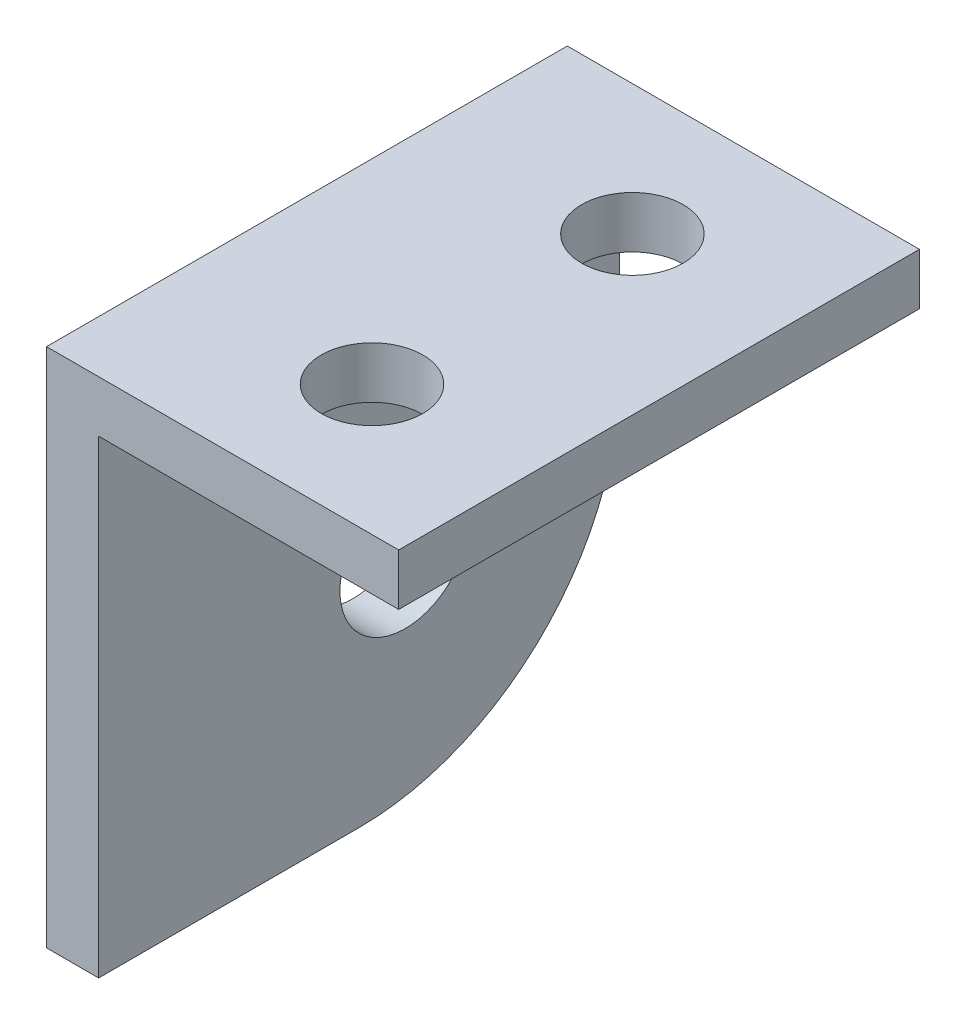
ISO-10303-21;
HEADER;
FILE_DESCRIPTION(('STEP AP214'),'2;1');
FILE_NAME('part.step','',(''),(''),'','','');
FILE_SCHEMA(('AUTOMOTIVE_DESIGN { 1 0 10303 214 1 1 1 1 }'));
ENDSEC;
DATA;
#1=APPLICATION_CONTEXT('core data for automotive mechanical design processes');
#2=APPLICATION_PROTOCOL_DEFINITION('international standard','automotive_design',2000,#1);
#3=PRODUCT_CONTEXT('',#1,'mechanical');
#4=PRODUCT('Part','Part','',(#3));
#5=PRODUCT_RELATED_PRODUCT_CATEGORY('part','',(#4));
#6=PRODUCT_DEFINITION_FORMATION('','',#4);
#7=PRODUCT_DEFINITION_CONTEXT('part definition',#1,'design');
#8=PRODUCT_DEFINITION('design','',#6,#7);
#9=PRODUCT_DEFINITION_SHAPE('','',#8);
#10=(LENGTH_UNIT() NAMED_UNIT(*) SI_UNIT(.MILLI.,.METRE.));
#11=(NAMED_UNIT(*) PLANE_ANGLE_UNIT() SI_UNIT($,.RADIAN.));
#12=(NAMED_UNIT(*) SI_UNIT($,.STERADIAN.) SOLID_ANGLE_UNIT());
#13=UNCERTAINTY_MEASURE_WITH_UNIT(LENGTH_MEASURE(1.E-05),#10,'distance_accuracy_value','');
#14=(GEOMETRIC_REPRESENTATION_CONTEXT(3) GLOBAL_UNCERTAINTY_ASSIGNED_CONTEXT((#13)) GLOBAL_UNIT_ASSIGNED_CONTEXT((#10,
#11,#12)) REPRESENTATION_CONTEXT('',''));
#15=CARTESIAN_POINT('',(0.,0.,0.));
#16=DIRECTION('',(0.,0.,1.));
#17=DIRECTION('',(1.,0.,0.));
#18=AXIS2_PLACEMENT_3D('',#15,#16,#17);
#19=CARTESIAN_POINT('',(4.47675,12.7,25.4));
#20=DIRECTION('',(0.,-1.,0.));
#21=DIRECTION('',(0.,0.,-1.));
#22=AXIS2_PLACEMENT_3D('',#19,#20,#21);
#23=PLANE('',#22);
#24=CARTESIAN_POINT('',(-3.175,12.7,19.05));
#25=DIRECTION('',(0.,-1.,0.));
#26=DIRECTION('',(1.,0.,0.));
#27=AXIS2_PLACEMENT_3D('',#24,#25,#26);
#28=CIRCLE('',#27,2.4765);
#29=CARTESIAN_POINT('',(-0.698500000000002,12.7,19.05));
#30=VERTEX_POINT('',#29);
#31=EDGE_CURVE('E149',#30,#30,#28,.T.);
#32=ORIENTED_EDGE('',*,*,#31,.T.);
#33=EDGE_LOOP('',(#32));
#34=FACE_BOUND('',#33,.T.);
#35=CARTESIAN_POINT('',(-3.175,12.7,6.35));
#36=DIRECTION('',(0.,-1.,0.));
#37=DIRECTION('',(1.,0.,0.));
#38=AXIS2_PLACEMENT_3D('',#35,#36,#37);
#39=CIRCLE('',#38,2.4765);
#40=CARTESIAN_POINT('',(-0.698499999999997,12.7,6.35));
#41=VERTEX_POINT('',#40);
#42=EDGE_CURVE('E155',#41,#41,#39,.T.);
#43=ORIENTED_EDGE('',*,*,#42,.T.);
#44=EDGE_LOOP('',(#43));
#45=FACE_BOUND('',#44,.T.);
#46=DIRECTION('',(-1.,0.,0.));
#47=VECTOR('',#46,1.);
#48=CARTESIAN_POINT('',(4.47675,12.7,0.));
#49=LINE('',#48,#47);
#50=CARTESIAN_POINT('',(4.47675,12.7,0.));
#51=VERTEX_POINT('',#50);
#52=CARTESIAN_POINT('',(-12.7,12.7,0.));
#53=VERTEX_POINT('',#52);
#54=EDGE_CURVE('E113',#51,#53,#49,.T.);
#55=ORIENTED_EDGE('',*,*,#54,.T.);
#56=DIRECTION('',(0.,0.,-1.));
#57=VECTOR('',#56,1.);
#58=CARTESIAN_POINT('',(-12.7,12.7,25.4));
#59=LINE('',#58,#57);
#60=CARTESIAN_POINT('',(-12.7,12.7,25.4));
#61=VERTEX_POINT('',#60);
#62=EDGE_CURVE('E94',#61,#53,#59,.T.);
#63=ORIENTED_EDGE('',*,*,#62,.F.);
#64=DIRECTION('',(-1.,0.,0.));
#65=VECTOR('',#64,1.);
#66=CARTESIAN_POINT('',(4.47675,12.7,25.4));
#67=LINE('',#66,#65);
#68=CARTESIAN_POINT('',(4.47675,12.7,25.4));
#69=VERTEX_POINT('',#68);
#70=EDGE_CURVE('E101',#69,#61,#67,.T.);
#71=ORIENTED_EDGE('',*,*,#70,.F.);
#72=DIRECTION('',(0.,0.,-1.));
#73=VECTOR('',#72,1.);
#74=CARTESIAN_POINT('',(4.47675,12.7,25.4));
#75=LINE('',#74,#73);
#76=EDGE_CURVE('E129',#69,#51,#75,.T.);
#77=ORIENTED_EDGE('',*,*,#76,.T.);
#78=EDGE_LOOP('',(#55,#63,#71,#77));
#79=FACE_BOUND('',#78,.T.);
#80=ADVANCED_FACE('F33',(#34,#45,#79),#23,.F.);
#81=CARTESIAN_POINT('',(-12.7,-12.7,25.4));
#82=DIRECTION('',(1.,0.,0.));
#83=DIRECTION('',(0.,0.,-1.));
#84=AXIS2_PLACEMENT_3D('',#81,#82,#83);
#85=PLANE('',#84);
#86=CARTESIAN_POINT('',(-12.7,-2.24506403026729,10.4549359697327));
#87=DIRECTION('',(1.,0.,0.));
#88=DIRECTION('',(0.,0.,-1.));
#89=AXIS2_PLACEMENT_3D('',#86,#87,#88);
#90=CIRCLE('',#89,3.175);
#91=CARTESIAN_POINT('',(-12.7,-2.24506403026729,7.27993596973271));
#92=VERTEX_POINT('',#91);
#93=EDGE_CURVE('E139',#92,#92,#90,.T.);
#94=ORIENTED_EDGE('',*,*,#93,.T.);
#95=EDGE_LOOP('',(#94));
#96=FACE_BOUND('',#95,.T.);
#97=DIRECTION('',(0.,-1.,0.));
#98=VECTOR('',#97,1.);
#99=CARTESIAN_POINT('',(-12.7,-12.7,0.));
#100=LINE('',#99,#98);
#101=CARTESIAN_POINT('',(-12.7,0.,0.));
#102=VERTEX_POINT('',#101);
#103=EDGE_CURVE('E136',#53,#102,#100,.T.);
#104=ORIENTED_EDGE('',*,*,#103,.T.);
#105=CARTESIAN_POINT('',(-12.7,0.,12.7));
#106=DIRECTION('',(1.,0.,0.));
#107=DIRECTION('',(0.,0.,-1.));
#108=AXIS2_PLACEMENT_3D('',#105,#106,#107);
#109=CIRCLE('',#108,12.7);
#110=CARTESIAN_POINT('',(-12.7,-12.7,12.7));
#111=VERTEX_POINT('',#110);
#112=EDGE_CURVE('E11',#102,#111,#109,.F.);
#113=ORIENTED_EDGE('',*,*,#112,.T.);
#114=DIRECTION('',(0.,0.,-1.));
#115=VECTOR('',#114,1.);
#116=CARTESIAN_POINT('',(-12.7,-12.7,25.4));
#117=LINE('',#116,#115);
#118=CARTESIAN_POINT('',(-12.7,-12.7,25.4));
#119=VERTEX_POINT('',#118);
#120=EDGE_CURVE('E97',#119,#111,#117,.T.);
#121=ORIENTED_EDGE('',*,*,#120,.F.);
#122=DIRECTION('',(0.,-1.,0.));
#123=VECTOR('',#122,1.);
#124=CARTESIAN_POINT('',(-12.7,-12.7,25.4));
#125=LINE('',#124,#123);
#126=EDGE_CURVE('E90',#61,#119,#125,.T.);
#127=ORIENTED_EDGE('',*,*,#126,.F.);
#128=ORIENTED_EDGE('',*,*,#62,.T.);
#129=EDGE_LOOP('',(#104,#113,#121,#127,#128));
#130=FACE_BOUND('',#129,.T.);
#131=ADVANCED_FACE('F92',(#96,#130),#85,.F.);
#132=CARTESIAN_POINT('',(-10.16,-12.7,25.4));
#133=DIRECTION('',(0.,1.,0.));
#134=DIRECTION('',(0.,0.,1.));
#135=AXIS2_PLACEMENT_3D('',#132,#133,#134);
#136=PLANE('',#135);
#137=ORIENTED_EDGE('',*,*,#120,.T.);
#138=DIRECTION('',(1.,0.,0.));
#139=VECTOR('',#138,1.);
#140=CARTESIAN_POINT('',(-10.16,-12.7,12.7));
#141=LINE('',#140,#139);
#142=CARTESIAN_POINT('',(-10.16,-12.7,12.7));
#143=VERTEX_POINT('',#142);
#144=EDGE_CURVE('E114',#111,#143,#141,.T.);
#145=ORIENTED_EDGE('',*,*,#144,.T.);
#146=DIRECTION('',(0.,0.,-1.));
#147=VECTOR('',#146,1.);
#148=CARTESIAN_POINT('',(-10.16,-12.7,25.4));
#149=LINE('',#148,#147);
#150=CARTESIAN_POINT('',(-10.16,-12.7,25.4));
#151=VERTEX_POINT('',#150);
#152=EDGE_CURVE('E118',#151,#143,#149,.T.);
#153=ORIENTED_EDGE('',*,*,#152,.F.);
#154=DIRECTION('',(1.,0.,0.));
#155=VECTOR('',#154,1.);
#156=CARTESIAN_POINT('',(-10.16,-12.7,25.4));
#157=LINE('',#156,#155);
#158=EDGE_CURVE('E100',#119,#151,#157,.T.);
#159=ORIENTED_EDGE('',*,*,#158,.F.);
#160=EDGE_LOOP('',(#137,#145,#153,#159));
#161=FACE_BOUND('',#160,.T.);
#162=ADVANCED_FACE('F193',(#161),#136,.F.);
#163=CARTESIAN_POINT('',(-10.16,10.1870608394639,25.4));
#164=DIRECTION('',(-1.,0.,0.));
#165=DIRECTION('',(0.,0.,1.));
#166=AXIS2_PLACEMENT_3D('',#163,#164,#165);
#167=PLANE('',#166);
#168=CARTESIAN_POINT('',(-10.16,-2.24506403026729,10.4549359697327));
#169=DIRECTION('',(1.,0.,0.));
#170=DIRECTION('',(0.,0.,-1.));
#171=AXIS2_PLACEMENT_3D('',#168,#169,#170);
#172=CIRCLE('',#171,3.175);
#173=CARTESIAN_POINT('',(-10.16,-2.24506403026729,7.27993596973271));
#174=VERTEX_POINT('',#173);
#175=EDGE_CURVE('E146',#174,#174,#172,.T.);
#176=ORIENTED_EDGE('',*,*,#175,.F.);
#177=EDGE_LOOP('',(#176));
#178=FACE_BOUND('',#177,.T.);
#179=ORIENTED_EDGE('',*,*,#152,.T.);
#180=CARTESIAN_POINT('',(-10.16,0.,12.7));
#181=DIRECTION('',(-1.,0.,0.));
#182=DIRECTION('',(0.,0.,1.));
#183=AXIS2_PLACEMENT_3D('',#180,#181,#182);
#184=CIRCLE('',#183,12.7);
#185=CARTESIAN_POINT('',(-10.16,0.,0.));
#186=VERTEX_POINT('',#185);
#187=EDGE_CURVE('E55',#143,#186,#184,.F.);
#188=ORIENTED_EDGE('',*,*,#187,.T.);
#189=DIRECTION('',(0.,1.,0.));
#190=VECTOR('',#189,1.);
#191=CARTESIAN_POINT('',(-10.16,10.1870608394639,0.));
#192=LINE('',#191,#190);
#193=CARTESIAN_POINT('',(-10.16,10.1870608394639,0.));
#194=VERTEX_POINT('',#193);
#195=EDGE_CURVE('E134',#186,#194,#192,.T.);
#196=ORIENTED_EDGE('',*,*,#195,.T.);
#197=DIRECTION('',(0.,0.,-1.));
#198=VECTOR('',#197,1.);
#199=CARTESIAN_POINT('',(-10.16,10.1870608394639,25.4));
#200=LINE('',#199,#198);
#201=CARTESIAN_POINT('',(-10.16,10.1870608394639,25.4));
#202=VERTEX_POINT('',#201);
#203=EDGE_CURVE('E123',#202,#194,#200,.T.);
#204=ORIENTED_EDGE('',*,*,#203,.F.);
#205=DIRECTION('',(0.,1.,0.));
#206=VECTOR('',#205,1.);
#207=CARTESIAN_POINT('',(-10.16,10.1870608394639,25.4));
#208=LINE('',#207,#206);
#209=EDGE_CURVE('E143',#151,#202,#208,.T.);
#210=ORIENTED_EDGE('',*,*,#209,.F.);
#211=EDGE_LOOP('',(#179,#188,#196,#204,#210));
#212=FACE_BOUND('',#211,.T.);
#213=ADVANCED_FACE('F177',(#178,#212),#167,.F.);
#214=CARTESIAN_POINT('',(4.47675,10.1870608394639,25.4));
#215=DIRECTION('',(0.,1.,0.));
#216=DIRECTION('',(-1.,0.,0.));
#217=AXIS2_PLACEMENT_3D('',#214,#215,#216);
#218=PLANE('',#217);
#219=CARTESIAN_POINT('',(-3.175,10.1870608394639,19.05));
#220=DIRECTION('',(0.,-1.,0.));
#221=DIRECTION('',(1.,0.,0.));
#222=AXIS2_PLACEMENT_3D('',#219,#220,#221);
#223=CIRCLE('',#222,2.4765);
#224=CARTESIAN_POINT('',(-0.698500000000002,10.1870608394639,19.05));
#225=VERTEX_POINT('',#224);
#226=EDGE_CURVE('E158',#225,#225,#223,.T.);
#227=ORIENTED_EDGE('',*,*,#226,.F.);
#228=EDGE_LOOP('',(#227));
#229=FACE_BOUND('',#228,.T.);
#230=CARTESIAN_POINT('',(-3.175,10.1870608394639,6.35));
#231=DIRECTION('',(0.,-1.,0.));
#232=DIRECTION('',(1.,0.,0.));
#233=AXIS2_PLACEMENT_3D('',#230,#231,#232);
#234=CIRCLE('',#233,2.4765);
#235=CARTESIAN_POINT('',(-0.698499999999997,10.1870608394639,6.35));
#236=VERTEX_POINT('',#235);
#237=EDGE_CURVE('E152',#236,#236,#234,.T.);
#238=ORIENTED_EDGE('',*,*,#237,.F.);
#239=EDGE_LOOP('',(#238));
#240=FACE_BOUND('',#239,.T.);
#241=DIRECTION('',(1.,0.,0.));
#242=VECTOR('',#241,1.);
#243=CARTESIAN_POINT('',(4.47675,10.1870608394639,0.));
#244=LINE('',#243,#242);
#245=CARTESIAN_POINT('',(4.47675,10.1870608394639,0.));
#246=VERTEX_POINT('',#245);
#247=EDGE_CURVE('E132',#194,#246,#244,.T.);
#248=ORIENTED_EDGE('',*,*,#247,.T.);
#249=DIRECTION('',(0.,0.,-1.));
#250=VECTOR('',#249,1.);
#251=CARTESIAN_POINT('',(4.47675,10.1870608394639,25.4));
#252=LINE('',#251,#250);
#253=CARTESIAN_POINT('',(4.47675,10.1870608394639,25.4));
#254=VERTEX_POINT('',#253);
#255=EDGE_CURVE('E126',#254,#246,#252,.T.);
#256=ORIENTED_EDGE('',*,*,#255,.F.);
#257=DIRECTION('',(1.,0.,0.));
#258=VECTOR('',#257,1.);
#259=CARTESIAN_POINT('',(4.47675,10.1870608394639,25.4));
#260=LINE('',#259,#258);
#261=EDGE_CURVE('E141',#202,#254,#260,.T.);
#262=ORIENTED_EDGE('',*,*,#261,.F.);
#263=ORIENTED_EDGE('',*,*,#203,.T.);
#264=EDGE_LOOP('',(#248,#256,#262,#263));
#265=FACE_BOUND('',#264,.T.);
#266=ADVANCED_FACE('F173',(#229,#240,#265),#218,.F.);
#267=CARTESIAN_POINT('',(4.47675,10.1870608394639,25.4));
#268=DIRECTION('',(-1.,0.,0.));
#269=DIRECTION('',(0.,0.,1.));
#270=AXIS2_PLACEMENT_3D('',#267,#268,#269);
#271=PLANE('',#270);
#272=DIRECTION('',(0.,1.,0.));
#273=VECTOR('',#272,1.);
#274=CARTESIAN_POINT('',(4.47675,10.1870608394639,0.));
#275=LINE('',#274,#273);
#276=EDGE_CURVE('E110',#246,#51,#275,.T.);
#277=ORIENTED_EDGE('',*,*,#276,.T.);
#278=ORIENTED_EDGE('',*,*,#76,.F.);
#279=DIRECTION('',(0.,1.,0.));
#280=VECTOR('',#279,1.);
#281=CARTESIAN_POINT('',(4.47675,10.1870608394639,25.4));
#282=LINE('',#281,#280);
#283=EDGE_CURVE('E106',#254,#69,#282,.T.);
#284=ORIENTED_EDGE('',*,*,#283,.F.);
#285=ORIENTED_EDGE('',*,*,#255,.T.);
#286=EDGE_LOOP('',(#277,#278,#284,#285));
#287=FACE_BOUND('',#286,.T.);
#288=ADVANCED_FACE('F176',(#287),#271,.F.);
#289=CARTESIAN_POINT('',(0.,0.,25.4));
#290=DIRECTION('',(0.,0.,-1.));
#291=DIRECTION('',(-1.,0.,0.));
#292=AXIS2_PLACEMENT_3D('',#289,#290,#291);
#293=PLANE('',#292);
#294=ORIENTED_EDGE('',*,*,#70,.T.);
#295=ORIENTED_EDGE('',*,*,#126,.T.);
#296=ORIENTED_EDGE('',*,*,#158,.T.);
#297=ORIENTED_EDGE('',*,*,#209,.T.);
#298=ORIENTED_EDGE('',*,*,#261,.T.);
#299=ORIENTED_EDGE('',*,*,#283,.T.);
#300=EDGE_LOOP('',(#294,#295,#296,#297,#298,#299));
#301=FACE_BOUND('',#300,.T.);
#302=ADVANCED_FACE('F104',(#301),#293,.F.);
#303=CARTESIAN_POINT('',(0.,0.,0.));
#304=DIRECTION('',(0.,0.,-1.));
#305=DIRECTION('',(-1.,0.,0.));
#306=AXIS2_PLACEMENT_3D('',#303,#304,#305);
#307=PLANE('',#306);
#308=ORIENTED_EDGE('',*,*,#195,.F.);
#309=DIRECTION('',(1.,0.,0.));
#310=VECTOR('',#309,1.);
#311=CARTESIAN_POINT('',(-12.7,0.,0.));
#312=LINE('',#311,#310);
#313=EDGE_CURVE('E41',#186,#102,#312,.F.);
#314=ORIENTED_EDGE('',*,*,#313,.T.);
#315=ORIENTED_EDGE('',*,*,#103,.F.);
#316=ORIENTED_EDGE('',*,*,#54,.F.);
#317=ORIENTED_EDGE('',*,*,#276,.F.);
#318=ORIENTED_EDGE('',*,*,#247,.F.);
#319=EDGE_LOOP('',(#308,#314,#315,#316,#317,#318));
#320=FACE_BOUND('',#319,.T.);
#321=ADVANCED_FACE('F187',(#320),#307,.T.);
#322=CARTESIAN_POINT('',(-10.16,0.,12.7));
#323=DIRECTION('',(-1.,0.,0.));
#324=DIRECTION('',(0.,0.,1.));
#325=AXIS2_PLACEMENT_3D('',#322,#323,#324);
#326=CYLINDRICAL_SURFACE('',#325,12.7);
#327=ORIENTED_EDGE('',*,*,#112,.F.);
#328=ORIENTED_EDGE('',*,*,#313,.F.);
#329=ORIENTED_EDGE('',*,*,#187,.F.);
#330=ORIENTED_EDGE('',*,*,#144,.F.);
#331=EDGE_LOOP('',(#327,#328,#329,#330));
#332=FACE_BOUND('',#331,.T.);
#333=ADVANCED_FACE('F35',(#332),#326,.T.);
#334=CARTESIAN_POINT('',(-12.7,-2.24506403026729,10.4549359697327));
#335=DIRECTION('',(1.,0.,0.));
#336=DIRECTION('',(0.,0.,-1.));
#337=AXIS2_PLACEMENT_3D('',#334,#335,#336);
#338=CYLINDRICAL_SURFACE('',#337,3.175);
#339=ORIENTED_EDGE('',*,*,#93,.F.);
#340=EDGE_LOOP('',(#339));
#341=FACE_BOUND('',#340,.T.);
#342=ORIENTED_EDGE('',*,*,#175,.T.);
#343=EDGE_LOOP('',(#342));
#344=FACE_BOUND('',#343,.T.);
#345=ADVANCED_FACE('F213',(#341,#344),#338,.F.);
#346=CARTESIAN_POINT('',(-3.175,12.7,6.35));
#347=DIRECTION('',(0.,-1.,0.));
#348=DIRECTION('',(1.,0.,0.));
#349=AXIS2_PLACEMENT_3D('',#346,#347,#348);
#350=CYLINDRICAL_SURFACE('',#349,2.4765);
#351=ORIENTED_EDGE('',*,*,#42,.F.);
#352=EDGE_LOOP('',(#351));
#353=FACE_BOUND('',#352,.T.);
#354=ORIENTED_EDGE('',*,*,#237,.T.);
#355=EDGE_LOOP('',(#354));
#356=FACE_BOUND('',#355,.T.);
#357=ADVANCED_FACE('F169',(#353,#356),#350,.F.);
#358=CARTESIAN_POINT('',(-3.175,12.7,19.05));
#359=DIRECTION('',(0.,-1.,0.));
#360=DIRECTION('',(1.,0.,0.));
#361=AXIS2_PLACEMENT_3D('',#358,#359,#360);
#362=CYLINDRICAL_SURFACE('',#361,2.4765);
#363=ORIENTED_EDGE('',*,*,#31,.F.);
#364=EDGE_LOOP('',(#363));
#365=FACE_BOUND('',#364,.T.);
#366=ORIENTED_EDGE('',*,*,#226,.T.);
#367=EDGE_LOOP('',(#366));
#368=FACE_BOUND('',#367,.T.);
#369=ADVANCED_FACE('F166',(#365,#368),#362,.F.);
#370=CLOSED_SHELL('',(#80,#131,#162,#213,#266,#288,#302,#321,#333,#345,#357,#369));
#371=MANIFOLD_SOLID_BREP('B2',#370);
#372=ADVANCED_BREP_SHAPE_REPRESENTATION('',(#18,#371),#14);
#373=SHAPE_DEFINITION_REPRESENTATION(#9,#372);
ENDSEC;
END-ISO-10303-21;
